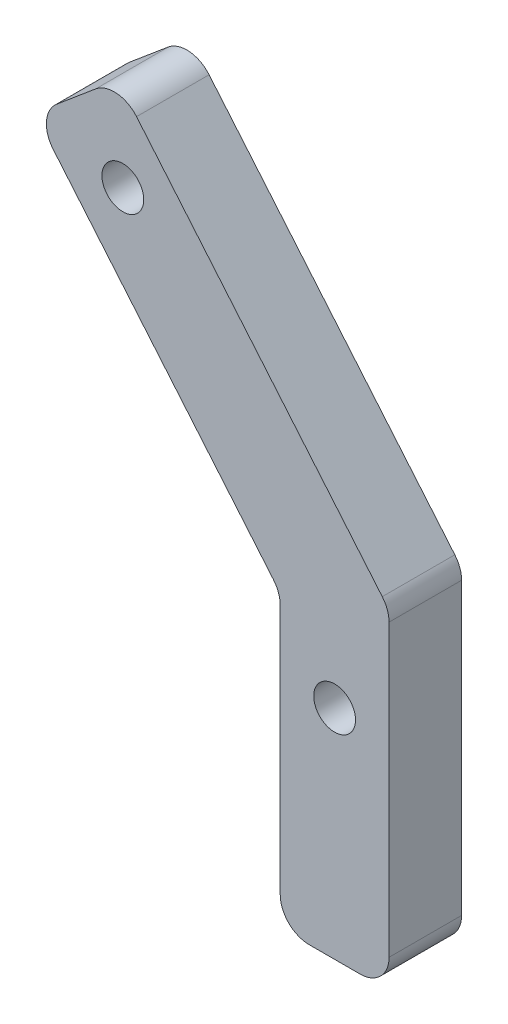
ISO-10303-21;
HEADER;
FILE_DESCRIPTION(('STEP AP214'),'2;1');
FILE_NAME('part.step','',(''),(''),'','','');
FILE_SCHEMA(('AUTOMOTIVE_DESIGN { 1 0 10303 214 1 1 1 1 }'));
ENDSEC;
DATA;
#1=APPLICATION_CONTEXT('core data for automotive mechanical design processes');
#2=APPLICATION_PROTOCOL_DEFINITION('international standard','automotive_design',2000,#1);
#3=PRODUCT_CONTEXT('',#1,'mechanical');
#4=PRODUCT('Part','Part','',(#3));
#5=PRODUCT_RELATED_PRODUCT_CATEGORY('part','',(#4));
#6=PRODUCT_DEFINITION_FORMATION('','',#4);
#7=PRODUCT_DEFINITION_CONTEXT('part definition',#1,'design');
#8=PRODUCT_DEFINITION('design','',#6,#7);
#9=PRODUCT_DEFINITION_SHAPE('','',#8);
#10=(LENGTH_UNIT() NAMED_UNIT(*) SI_UNIT(.MILLI.,.METRE.));
#11=(NAMED_UNIT(*) PLANE_ANGLE_UNIT() SI_UNIT($,.RADIAN.));
#12=(NAMED_UNIT(*) SI_UNIT($,.STERADIAN.) SOLID_ANGLE_UNIT());
#13=UNCERTAINTY_MEASURE_WITH_UNIT(LENGTH_MEASURE(1.E-05),#10,'distance_accuracy_value','');
#14=(GEOMETRIC_REPRESENTATION_CONTEXT(3) GLOBAL_UNCERTAINTY_ASSIGNED_CONTEXT((#13)) GLOBAL_UNIT_ASSIGNED_CONTEXT((#10,
#11,#12)) REPRESENTATION_CONTEXT('',''));
#15=CARTESIAN_POINT('',(0.,0.,0.));
#16=DIRECTION('',(0.,0.,1.));
#17=DIRECTION('',(1.,0.,0.));
#18=AXIS2_PLACEMENT_3D('',#15,#16,#17);
#19=CARTESIAN_POINT('',(0.,0.,6.35));
#20=DIRECTION('',(0.766044443118977,0.64278760968654,0.));
#21=DIRECTION('',(-0.64278760968654,0.766044443118977,0.));
#22=AXIS2_PLACEMENT_3D('',#19,#20,#21);
#23=PLANE('',#22);
#24=DIRECTION('',(0.64278760968654,-0.766044443118977,0.));
#25=VECTOR('',#24,1.);
#26=CARTESIAN_POINT('',(0.,0.,0.));
#27=LINE('',#26,#25);
#28=CARTESIAN_POINT('',(1.63268052860381,-1.9457528855222,0.));
#29=VERTEX_POINT('',#28);
#30=CARTESIAN_POINT('',(20.9097350652192,-24.919251884168,0.));
#31=VERTEX_POINT('',#30);
#32=EDGE_CURVE('E231',#29,#31,#27,.T.);
#33=ORIENTED_EDGE('',*,*,#32,.T.);
#34=DIRECTION('',(0.,0.,-1.));
#35=VECTOR('',#34,1.);
#36=CARTESIAN_POINT('',(20.9097350652192,-24.919251884168,6.35));
#37=LINE('',#36,#35);
#38=CARTESIAN_POINT('',(20.9097350652192,-24.919251884168,6.35));
#39=VERTEX_POINT('',#38);
#40=EDGE_CURVE('E212',#31,#39,#37,.F.);
#41=ORIENTED_EDGE('',*,*,#40,.T.);
#42=DIRECTION('',(0.64278760968654,-0.766044443118977,0.));
#43=VECTOR('',#42,1.);
#44=CARTESIAN_POINT('',(0.,0.,6.35));
#45=LINE('',#44,#43);
#46=CARTESIAN_POINT('',(1.63268052860381,-1.9457528855222,6.35));
#47=VERTEX_POINT('',#46);
#48=EDGE_CURVE('E164',#47,#39,#45,.T.);
#49=ORIENTED_EDGE('',*,*,#48,.F.);
#50=DIRECTION('',(0.,0.,-1.));
#51=VECTOR('',#50,1.);
#52=CARTESIAN_POINT('',(1.63268052860381,-1.9457528855222,6.35));
#53=LINE('',#52,#51);
#54=EDGE_CURVE('E208',#47,#29,#53,.T.);
#55=ORIENTED_EDGE('',*,*,#54,.T.);
#56=EDGE_LOOP('',(#33,#41,#49,#55));
#57=FACE_BOUND('',#56,.T.);
#58=ADVANCED_FACE('F39',(#57),#23,.F.);
#59=CARTESIAN_POINT('',(21.503982179697,-25.6274480177357,6.35));
#60=DIRECTION('',(1.,0.,0.));
#61=DIRECTION('',(0.,0.,-1.));
#62=AXIS2_PLACEMENT_3D('',#59,#60,#61);
#63=PLANE('',#62);
#64=DIRECTION('',(0.,-1.,0.));
#65=VECTOR('',#64,1.);
#66=CARTESIAN_POINT('',(21.503982179697,-25.6274480177357,6.35));
#67=LINE('',#66,#65);
#68=CARTESIAN_POINT('',(21.503982179697,-26.5519324127719,6.35));
#69=VERTEX_POINT('',#68);
#70=CARTESIAN_POINT('',(21.503982179697,-48.4874480177357,6.35));
#71=VERTEX_POINT('',#70);
#72=EDGE_CURVE('E250',#69,#71,#67,.T.);
#73=ORIENTED_EDGE('',*,*,#72,.F.);
#74=DIRECTION('',(0.,0.,-1.));
#75=VECTOR('',#74,1.);
#76=CARTESIAN_POINT('',(21.503982179697,-26.5519324127719,0.));
#77=LINE('',#76,#75);
#78=CARTESIAN_POINT('',(21.503982179697,-26.5519324127719,0.));
#79=VERTEX_POINT('',#78);
#80=EDGE_CURVE('E204',#69,#79,#77,.T.);
#81=ORIENTED_EDGE('',*,*,#80,.T.);
#82=DIRECTION('',(0.,-1.,0.));
#83=VECTOR('',#82,1.);
#84=CARTESIAN_POINT('',(21.503982179697,-25.6274480177357,0.));
#85=LINE('',#84,#83);
#86=CARTESIAN_POINT('',(21.503982179697,-48.4874480177357,0.));
#87=VERTEX_POINT('',#86);
#88=EDGE_CURVE('E233',#79,#87,#85,.T.);
#89=ORIENTED_EDGE('',*,*,#88,.T.);
#90=DIRECTION('',(0.,0.,-1.));
#91=VECTOR('',#90,1.);
#92=CARTESIAN_POINT('',(21.503982179697,-48.4874480177357,6.35));
#93=LINE('',#92,#91);
#94=EDGE_CURVE('E201',#87,#71,#93,.F.);
#95=ORIENTED_EDGE('',*,*,#94,.T.);
#96=EDGE_LOOP('',(#73,#81,#89,#95));
#97=FACE_BOUND('',#96,.T.);
#98=ADVANCED_FACE('F253',(#97),#63,.F.);
#99=CARTESIAN_POINT('',(21.503982179697,-51.0274480177357,6.35));
#100=DIRECTION('',(0.,1.,0.));
#101=DIRECTION('',(0.,0.,1.));
#102=AXIS2_PLACEMENT_3D('',#99,#100,#101);
#103=PLANE('',#102);
#104=DIRECTION('',(1.,0.,0.));
#105=VECTOR('',#104,1.);
#106=CARTESIAN_POINT('',(21.503982179697,-51.0274480177357,0.));
#107=LINE('',#106,#105);
#108=CARTESIAN_POINT('',(24.043982179697,-51.0274480177357,0.));
#109=VERTEX_POINT('',#108);
#110=CARTESIAN_POINT('',(28.488982179697,-51.0274480177357,0.));
#111=VERTEX_POINT('',#110);
#112=EDGE_CURVE('E166',#109,#111,#107,.T.);
#113=ORIENTED_EDGE('',*,*,#112,.T.);
#114=DIRECTION('',(0.,0.,-1.));
#115=VECTOR('',#114,1.);
#116=CARTESIAN_POINT('',(28.488982179697,-51.0274480177357,6.35));
#117=LINE('',#116,#115);
#118=CARTESIAN_POINT('',(28.488982179697,-51.0274480177357,6.35));
#119=VERTEX_POINT('',#118);
#120=EDGE_CURVE('E225',#111,#119,#117,.F.);
#121=ORIENTED_EDGE('',*,*,#120,.T.);
#122=DIRECTION('',(1.,0.,0.));
#123=VECTOR('',#122,1.);
#124=CARTESIAN_POINT('',(21.503982179697,-51.0274480177357,6.35));
#125=LINE('',#124,#123);
#126=CARTESIAN_POINT('',(24.043982179697,-51.0274480177357,6.35));
#127=VERTEX_POINT('',#126);
#128=EDGE_CURVE('E256',#127,#119,#125,.T.);
#129=ORIENTED_EDGE('',*,*,#128,.F.);
#130=DIRECTION('',(0.,0.,-1.));
#131=VECTOR('',#130,1.);
#132=CARTESIAN_POINT('',(24.043982179697,-51.0274480177357,6.35));
#133=LINE('',#132,#131);
#134=EDGE_CURVE('E221',#127,#109,#133,.T.);
#135=ORIENTED_EDGE('',*,*,#134,.T.);
#136=EDGE_LOOP('',(#113,#121,#129,#135));
#137=FACE_BOUND('',#136,.T.);
#138=ADVANCED_FACE('F278',(#137),#103,.F.);
#139=CARTESIAN_POINT('',(31.028982179697,-22.1606315363501,6.35));
#140=DIRECTION('',(-1.,0.,0.));
#141=DIRECTION('',(0.,-1.,0.));
#142=AXIS2_PLACEMENT_3D('',#139,#140,#141);
#143=PLANE('',#142);
#144=DIRECTION('',(0.,1.,0.));
#145=VECTOR('',#144,1.);
#146=CARTESIAN_POINT('',(31.028982179697,-22.1606315363501,0.));
#147=LINE('',#146,#145);
#148=CARTESIAN_POINT('',(31.028982179697,-48.4874480177357,0.));
#149=VERTEX_POINT('',#148);
#150=CARTESIAN_POINT('',(31.028982179697,-23.0851159313863,0.));
#151=VERTEX_POINT('',#150);
#152=EDGE_CURVE('E160',#149,#151,#147,.T.);
#153=ORIENTED_EDGE('',*,*,#152,.T.);
#154=DIRECTION('',(0.,0.,-1.));
#155=VECTOR('',#154,1.);
#156=CARTESIAN_POINT('',(31.028982179697,-23.0851159313863,6.35));
#157=LINE('',#156,#155);
#158=CARTESIAN_POINT('',(31.028982179697,-23.0851159313863,6.35));
#159=VERTEX_POINT('',#158);
#160=EDGE_CURVE('E135',#151,#159,#157,.F.);
#161=ORIENTED_EDGE('',*,*,#160,.T.);
#162=DIRECTION('',(0.,1.,0.));
#163=VECTOR('',#162,1.);
#164=CARTESIAN_POINT('',(31.028982179697,-22.1606315363501,6.35));
#165=LINE('',#164,#163);
#166=CARTESIAN_POINT('',(31.028982179697,-48.4874480177357,6.35));
#167=VERTEX_POINT('',#166);
#168=EDGE_CURVE('E261',#167,#159,#165,.T.);
#169=ORIENTED_EDGE('',*,*,#168,.F.);
#170=DIRECTION('',(0.,0.,-1.));
#171=VECTOR('',#170,1.);
#172=CARTESIAN_POINT('',(31.028982179697,-48.4874480177357,6.35));
#173=LINE('',#172,#171);
#174=EDGE_CURVE('E141',#167,#149,#173,.T.);
#175=ORIENTED_EDGE('',*,*,#174,.T.);
#176=EDGE_LOOP('',(#153,#161,#169,#175));
#177=FACE_BOUND('',#176,.T.);
#178=ADVANCED_FACE('F287',(#177),#143,.F.);
#179=CARTESIAN_POINT('',(7.29657332070826,6.1225519822643,6.35));
#180=DIRECTION('',(-0.766044443118977,-0.64278760968654,0.));
#181=DIRECTION('',(0.642787609686541,-0.766044443118977,0.));
#182=AXIS2_PLACEMENT_3D('',#179,#180,#181);
#183=PLANE('',#182);
#184=DIRECTION('',(-0.642787609686541,0.766044443118977,0.));
#185=VECTOR('',#184,1.);
#186=CARTESIAN_POINT('',(7.29657332070826,6.1225519822643,6.35));
#187=LINE('',#186,#185);
#188=CARTESIAN_POINT('',(30.4347350652192,-21.4524354027824,6.35));
#189=VERTEX_POINT('',#188);
#190=CARTESIAN_POINT('',(8.92925384931207,4.1767990967421,6.35));
#191=VERTEX_POINT('',#190);
#192=EDGE_CURVE('E150',#189,#191,#187,.T.);
#193=ORIENTED_EDGE('',*,*,#192,.F.);
#194=DIRECTION('',(0.,0.,-1.));
#195=VECTOR('',#194,1.);
#196=CARTESIAN_POINT('',(30.4347350652192,-21.4524354027824,6.35));
#197=LINE('',#196,#195);
#198=CARTESIAN_POINT('',(30.4347350652192,-21.4524354027824,0.));
#199=VERTEX_POINT('',#198);
#200=EDGE_CURVE('E134',#189,#199,#197,.T.);
#201=ORIENTED_EDGE('',*,*,#200,.T.);
#202=DIRECTION('',(-0.642787609686541,0.766044443118977,0.));
#203=VECTOR('',#202,1.);
#204=CARTESIAN_POINT('',(7.29657332070826,6.1225519822643,0.));
#205=LINE('',#204,#203);
#206=CARTESIAN_POINT('',(8.92925384931207,4.1767990967421,0.));
#207=VERTEX_POINT('',#206);
#208=EDGE_CURVE('E148',#199,#207,#205,.T.);
#209=ORIENTED_EDGE('',*,*,#208,.T.);
#210=DIRECTION('',(0.,0.,-1.));
#211=VECTOR('',#210,1.);
#212=CARTESIAN_POINT('',(8.92925384931207,4.1767990967421,6.35));
#213=LINE('',#212,#211);
#214=EDGE_CURVE('E153',#207,#191,#213,.F.);
#215=ORIENTED_EDGE('',*,*,#214,.T.);
#216=EDGE_LOOP('',(#193,#201,#209,#215));
#217=FACE_BOUND('',#216,.T.);
#218=ADVANCED_FACE('F147',(#217),#183,.F.);
#219=CARTESIAN_POINT('',(0.,0.,6.35));
#220=DIRECTION('',(0.642787609686541,-0.766044443118977,0.));
#221=DIRECTION('',(0.766044443118977,0.642787609686541,0.));
#222=AXIS2_PLACEMENT_3D('',#219,#220,#221);
#223=PLANE('',#222);
#224=DIRECTION('',(-0.766044443118977,-0.642787609686541,0.));
#225=VECTOR('',#224,1.);
#226=CARTESIAN_POINT('',(0.,0.,0.));
#227=LINE('',#226,#225);
#228=CARTESIAN_POINT('',(5.35082043518606,4.48987145366049,0.));
#229=VERTEX_POINT('',#228);
#230=CARTESIAN_POINT('',(1.9457528855222,1.63268052860381,0.));
#231=VERTEX_POINT('',#230);
#232=EDGE_CURVE('E159',#229,#231,#227,.T.);
#233=ORIENTED_EDGE('',*,*,#232,.T.);
#234=DIRECTION('',(0.,0.,-1.));
#235=VECTOR('',#234,1.);
#236=CARTESIAN_POINT('',(1.9457528855222,1.63268052860381,6.35));
#237=LINE('',#236,#235);
#238=CARTESIAN_POINT('',(1.9457528855222,1.63268052860381,6.35));
#239=VERTEX_POINT('',#238);
#240=EDGE_CURVE('E55',#231,#239,#237,.F.);
#241=ORIENTED_EDGE('',*,*,#240,.T.);
#242=DIRECTION('',(-0.766044443118977,-0.642787609686541,0.));
#243=VECTOR('',#242,1.);
#244=CARTESIAN_POINT('',(0.,0.,6.35));
#245=LINE('',#244,#243);
#246=CARTESIAN_POINT('',(5.35082043518606,4.48987145366049,6.35));
#247=VERTEX_POINT('',#246);
#248=EDGE_CURVE('E171',#247,#239,#245,.T.);
#249=ORIENTED_EDGE('',*,*,#248,.F.);
#250=DIRECTION('',(0.,0.,-1.));
#251=VECTOR('',#250,1.);
#252=CARTESIAN_POINT('',(5.35082043518606,4.48987145366049,6.35));
#253=LINE('',#252,#251);
#254=EDGE_CURVE('E215',#247,#229,#253,.T.);
#255=ORIENTED_EDGE('',*,*,#254,.T.);
#256=EDGE_LOOP('',(#233,#241,#249,#255));
#257=FACE_BOUND('',#256,.T.);
#258=ADVANCED_FACE('F294',(#257),#223,.F.);
#259=CARTESIAN_POINT('',(0.,0.,6.35));
#260=DIRECTION('',(0.,0.,1.));
#261=DIRECTION('',(1.,0.,0.));
#262=AXIS2_PLACEMENT_3D('',#259,#260,#261);
#263=PLANE('',#262);
#264=CARTESIAN_POINT('',(7.72998798186366,-1.80310622267335,6.35));
#265=DIRECTION('',(0.,0.,1.));
#266=DIRECTION('',(1.,0.,0.));
#267=AXIS2_PLACEMENT_3D('',#264,#265,#266);
#268=CIRCLE('',#267,1.8288);
#269=CARTESIAN_POINT('',(9.55878798186366,-1.80310622267335,6.35));
#270=VERTEX_POINT('',#269);
#271=EDGE_CURVE('E443',#270,#270,#268,.T.);
#272=ORIENTED_EDGE('',*,*,#271,.F.);
#273=EDGE_LOOP('',(#272));
#274=FACE_BOUND('',#273,.T.);
#275=CARTESIAN_POINT('',(26.266482179697,-31.9774480177357,6.35));
#276=DIRECTION('',(0.,0.,1.));
#277=DIRECTION('',(1.,0.,0.));
#278=AXIS2_PLACEMENT_3D('',#275,#276,#277);
#279=CIRCLE('',#278,1.8288);
#280=CARTESIAN_POINT('',(28.095282179697,-31.9774480177357,6.35));
#281=VERTEX_POINT('',#280);
#282=EDGE_CURVE('E437',#281,#281,#279,.T.);
#283=ORIENTED_EDGE('',*,*,#282,.F.);
#284=EDGE_LOOP('',(#283));
#285=FACE_BOUND('',#284,.T.);
#286=ORIENTED_EDGE('',*,*,#168,.T.);
#287=CARTESIAN_POINT('',(28.488982179697,-23.0851159313863,6.35));
#288=DIRECTION('',(0.,0.,1.));
#289=DIRECTION('',(1.,0.,0.));
#290=AXIS2_PLACEMENT_3D('',#287,#288,#289);
#291=CIRCLE('',#290,2.54);
#292=EDGE_CURVE('E198',#159,#189,#291,.T.);
#293=ORIENTED_EDGE('',*,*,#292,.T.);
#294=ORIENTED_EDGE('',*,*,#192,.T.);
#295=CARTESIAN_POINT('',(6.98350096378987,2.54411856813829,6.35));
#296=DIRECTION('',(0.,0.,1.));
#297=DIRECTION('',(1.,0.,0.));
#298=AXIS2_PLACEMENT_3D('',#295,#296,#297);
#299=CIRCLE('',#298,2.54);
#300=EDGE_CURVE('E62',#191,#247,#299,.T.);
#301=ORIENTED_EDGE('',*,*,#300,.T.);
#302=ORIENTED_EDGE('',*,*,#248,.T.);
#303=CARTESIAN_POINT('',(3.57843341412601,-0.313072356918388,6.35));
#304=DIRECTION('',(0.,0.,1.));
#305=DIRECTION('',(1.,0.,0.));
#306=AXIS2_PLACEMENT_3D('',#303,#304,#305);
#307=CIRCLE('',#306,2.54);
#308=EDGE_CURVE('E195',#239,#47,#307,.T.);
#309=ORIENTED_EDGE('',*,*,#308,.T.);
#310=ORIENTED_EDGE('',*,*,#48,.T.);
#311=CARTESIAN_POINT('',(18.963982179697,-26.5519324127719,6.35));
#312=DIRECTION('',(0.,0.,1.));
#313=DIRECTION('',(1.,0.,0.));
#314=AXIS2_PLACEMENT_3D('',#311,#312,#313);
#315=CIRCLE('',#314,2.54);
#316=EDGE_CURVE('E11',#39,#69,#315,.F.);
#317=ORIENTED_EDGE('',*,*,#316,.T.);
#318=ORIENTED_EDGE('',*,*,#72,.T.);
#319=CARTESIAN_POINT('',(24.043982179697,-48.4874480177357,6.35));
#320=DIRECTION('',(0.,0.,1.));
#321=DIRECTION('',(1.,0.,0.));
#322=AXIS2_PLACEMENT_3D('',#319,#320,#321);
#323=CIRCLE('',#322,2.54);
#324=EDGE_CURVE('E187',#71,#127,#323,.T.);
#325=ORIENTED_EDGE('',*,*,#324,.T.);
#326=ORIENTED_EDGE('',*,*,#128,.T.);
#327=CARTESIAN_POINT('',(28.488982179697,-48.4874480177357,6.35));
#328=DIRECTION('',(0.,0.,1.));
#329=DIRECTION('',(1.,0.,0.));
#330=AXIS2_PLACEMENT_3D('',#327,#328,#329);
#331=CIRCLE('',#330,2.54);
#332=EDGE_CURVE('E190',#119,#167,#331,.T.);
#333=ORIENTED_EDGE('',*,*,#332,.T.);
#334=EDGE_LOOP('',(#286,#293,#294,#301,#302,#309,#310,#317,#318,#325,#326,#333));
#335=FACE_BOUND('',#334,.T.);
#336=ADVANCED_FACE('F249',(#274,#285,#335),#263,.T.);
#337=CARTESIAN_POINT('',(0.,0.,0.));
#338=DIRECTION('',(0.,0.,1.));
#339=DIRECTION('',(1.,0.,0.));
#340=AXIS2_PLACEMENT_3D('',#337,#338,#339);
#341=PLANE('',#340);
#342=CARTESIAN_POINT('',(7.72998798186366,-1.80310622267335,0.));
#343=DIRECTION('',(0.,0.,1.));
#344=DIRECTION('',(1.,0.,0.));
#345=AXIS2_PLACEMENT_3D('',#342,#343,#344);
#346=CIRCLE('',#345,1.8288);
#347=CARTESIAN_POINT('',(9.55878798186366,-1.80310622267335,0.));
#348=VERTEX_POINT('',#347);
#349=EDGE_CURVE('E433',#348,#348,#346,.T.);
#350=ORIENTED_EDGE('',*,*,#349,.T.);
#351=EDGE_LOOP('',(#350));
#352=FACE_BOUND('',#351,.T.);
#353=CARTESIAN_POINT('',(26.266482179697,-31.9774480177357,0.));
#354=DIRECTION('',(0.,0.,1.));
#355=DIRECTION('',(1.,0.,0.));
#356=AXIS2_PLACEMENT_3D('',#353,#354,#355);
#357=CIRCLE('',#356,1.8288);
#358=CARTESIAN_POINT('',(28.095282179697,-31.9774480177357,0.));
#359=VERTEX_POINT('',#358);
#360=EDGE_CURVE('E242',#359,#359,#357,.T.);
#361=ORIENTED_EDGE('',*,*,#360,.T.);
#362=EDGE_LOOP('',(#361));
#363=FACE_BOUND('',#362,.T.);
#364=ORIENTED_EDGE('',*,*,#208,.F.);
#365=CARTESIAN_POINT('',(28.488982179697,-23.0851159313863,0.));
#366=DIRECTION('',(0.,0.,1.));
#367=DIRECTION('',(1.,0.,0.));
#368=AXIS2_PLACEMENT_3D('',#365,#366,#367);
#369=CIRCLE('',#368,2.54);
#370=EDGE_CURVE('E130',#199,#151,#369,.F.);
#371=ORIENTED_EDGE('',*,*,#370,.T.);
#372=ORIENTED_EDGE('',*,*,#152,.F.);
#373=CARTESIAN_POINT('',(28.488982179697,-48.4874480177357,0.));
#374=DIRECTION('',(0.,0.,1.));
#375=DIRECTION('',(1.,0.,0.));
#376=AXIS2_PLACEMENT_3D('',#373,#374,#375);
#377=CIRCLE('',#376,2.54);
#378=EDGE_CURVE('E175',#149,#111,#377,.F.);
#379=ORIENTED_EDGE('',*,*,#378,.T.);
#380=ORIENTED_EDGE('',*,*,#112,.F.);
#381=CARTESIAN_POINT('',(24.043982179697,-48.4874480177357,0.));
#382=DIRECTION('',(0.,0.,1.));
#383=DIRECTION('',(1.,0.,0.));
#384=AXIS2_PLACEMENT_3D('',#381,#382,#383);
#385=CIRCLE('',#384,2.54);
#386=EDGE_CURVE('E152',#109,#87,#385,.F.);
#387=ORIENTED_EDGE('',*,*,#386,.T.);
#388=ORIENTED_EDGE('',*,*,#88,.F.);
#389=CARTESIAN_POINT('',(18.963982179697,-26.5519324127719,0.));
#390=DIRECTION('',(0.,0.,1.));
#391=DIRECTION('',(1.,0.,0.));
#392=AXIS2_PLACEMENT_3D('',#389,#390,#391);
#393=CIRCLE('',#392,2.54);
#394=EDGE_CURVE('E48',#79,#31,#393,.T.);
#395=ORIENTED_EDGE('',*,*,#394,.T.);
#396=ORIENTED_EDGE('',*,*,#32,.F.);
#397=CARTESIAN_POINT('',(3.57843341412601,-0.313072356918388,0.));
#398=DIRECTION('',(0.,0.,1.));
#399=DIRECTION('',(1.,0.,0.));
#400=AXIS2_PLACEMENT_3D('',#397,#398,#399);
#401=CIRCLE('',#400,2.54);
#402=EDGE_CURVE('E142',#29,#231,#401,.F.);
#403=ORIENTED_EDGE('',*,*,#402,.T.);
#404=ORIENTED_EDGE('',*,*,#232,.F.);
#405=CARTESIAN_POINT('',(6.98350096378987,2.54411856813829,0.));
#406=DIRECTION('',(0.,0.,1.));
#407=DIRECTION('',(1.,0.,0.));
#408=AXIS2_PLACEMENT_3D('',#405,#406,#407);
#409=CIRCLE('',#408,2.54);
#410=EDGE_CURVE('E157',#229,#207,#409,.F.);
#411=ORIENTED_EDGE('',*,*,#410,.T.);
#412=EDGE_LOOP('',(#364,#371,#372,#379,#380,#387,#388,#395,#396,#403,#404,#411));
#413=FACE_BOUND('',#412,.T.);
#414=ADVANCED_FACE('F155',(#352,#363,#413),#341,.F.);
#415=CARTESIAN_POINT('',(28.488982179697,-23.0851159313863,6.35));
#416=DIRECTION('',(0.,0.,-1.));
#417=DIRECTION('',(-1.,0.,0.));
#418=AXIS2_PLACEMENT_3D('',#415,#416,#417);
#419=CYLINDRICAL_SURFACE('',#418,2.54);
#420=ORIENTED_EDGE('',*,*,#292,.F.);
#421=ORIENTED_EDGE('',*,*,#160,.F.);
#422=ORIENTED_EDGE('',*,*,#370,.F.);
#423=ORIENTED_EDGE('',*,*,#200,.F.);
#424=EDGE_LOOP('',(#420,#421,#422,#423));
#425=FACE_BOUND('',#424,.T.);
#426=ADVANCED_FACE('F133',(#425),#419,.T.);
#427=CARTESIAN_POINT('',(18.963982179697,-26.5519324127719,6.35));
#428=DIRECTION('',(0.,0.,1.));
#429=DIRECTION('',(1.,0.,0.));
#430=AXIS2_PLACEMENT_3D('',#427,#428,#429);
#431=CYLINDRICAL_SURFACE('',#430,2.54);
#432=ORIENTED_EDGE('',*,*,#316,.F.);
#433=ORIENTED_EDGE('',*,*,#40,.F.);
#434=ORIENTED_EDGE('',*,*,#394,.F.);
#435=ORIENTED_EDGE('',*,*,#80,.F.);
#436=EDGE_LOOP('',(#432,#433,#434,#435));
#437=FACE_BOUND('',#436,.T.);
#438=ADVANCED_FACE('F245',(#437),#431,.F.);
#439=CARTESIAN_POINT('',(3.57843341412601,-0.313072356918388,6.35));
#440=DIRECTION('',(0.,0.,-1.));
#441=DIRECTION('',(-1.,0.,0.));
#442=AXIS2_PLACEMENT_3D('',#439,#440,#441);
#443=CYLINDRICAL_SURFACE('',#442,2.54);
#444=ORIENTED_EDGE('',*,*,#308,.F.);
#445=ORIENTED_EDGE('',*,*,#240,.F.);
#446=ORIENTED_EDGE('',*,*,#402,.F.);
#447=ORIENTED_EDGE('',*,*,#54,.F.);
#448=EDGE_LOOP('',(#444,#445,#446,#447));
#449=FACE_BOUND('',#448,.T.);
#450=ADVANCED_FACE('F308',(#449),#443,.T.);
#451=CARTESIAN_POINT('',(6.98350096378987,2.54411856813829,6.35));
#452=DIRECTION('',(0.,0.,-1.));
#453=DIRECTION('',(-1.,0.,0.));
#454=AXIS2_PLACEMENT_3D('',#451,#452,#453);
#455=CYLINDRICAL_SURFACE('',#454,2.54);
#456=ORIENTED_EDGE('',*,*,#300,.F.);
#457=ORIENTED_EDGE('',*,*,#214,.F.);
#458=ORIENTED_EDGE('',*,*,#410,.F.);
#459=ORIENTED_EDGE('',*,*,#254,.F.);
#460=EDGE_LOOP('',(#456,#457,#458,#459));
#461=FACE_BOUND('',#460,.T.);
#462=ADVANCED_FACE('F311',(#461),#455,.T.);
#463=CARTESIAN_POINT('',(28.488982179697,-48.4874480177357,6.35));
#464=DIRECTION('',(0.,0.,-1.));
#465=DIRECTION('',(-1.,0.,0.));
#466=AXIS2_PLACEMENT_3D('',#463,#464,#465);
#467=CYLINDRICAL_SURFACE('',#466,2.54);
#468=ORIENTED_EDGE('',*,*,#332,.F.);
#469=ORIENTED_EDGE('',*,*,#120,.F.);
#470=ORIENTED_EDGE('',*,*,#378,.F.);
#471=ORIENTED_EDGE('',*,*,#174,.F.);
#472=EDGE_LOOP('',(#468,#469,#470,#471));
#473=FACE_BOUND('',#472,.T.);
#474=ADVANCED_FACE('F283',(#473),#467,.T.);
#475=CARTESIAN_POINT('',(24.043982179697,-48.4874480177357,6.35));
#476=DIRECTION('',(0.,0.,-1.));
#477=DIRECTION('',(-1.,0.,0.));
#478=AXIS2_PLACEMENT_3D('',#475,#476,#477);
#479=CYLINDRICAL_SURFACE('',#478,2.54);
#480=ORIENTED_EDGE('',*,*,#324,.F.);
#481=ORIENTED_EDGE('',*,*,#94,.F.);
#482=ORIENTED_EDGE('',*,*,#386,.F.);
#483=ORIENTED_EDGE('',*,*,#134,.F.);
#484=EDGE_LOOP('',(#480,#481,#482,#483));
#485=FACE_BOUND('',#484,.T.);
#486=ADVANCED_FACE('F41',(#485),#479,.T.);
#487=CARTESIAN_POINT('',(26.266482179697,-31.9774480177357,6.35));
#488=DIRECTION('',(0.,0.,1.));
#489=DIRECTION('',(1.,0.,0.));
#490=AXIS2_PLACEMENT_3D('',#487,#488,#489);
#491=CYLINDRICAL_SURFACE('',#490,1.8288);
#492=ORIENTED_EDGE('',*,*,#282,.T.);
#493=EDGE_LOOP('',(#492));
#494=FACE_BOUND('',#493,.T.);
#495=ORIENTED_EDGE('',*,*,#360,.F.);
#496=EDGE_LOOP('',(#495));
#497=FACE_BOUND('',#496,.T.);
#498=ADVANCED_FACE('F319',(#494,#497),#491,.F.);
#499=CARTESIAN_POINT('',(7.72998798186366,-1.80310622267335,6.35));
#500=DIRECTION('',(0.,0.,1.));
#501=DIRECTION('',(1.,0.,0.));
#502=AXIS2_PLACEMENT_3D('',#499,#500,#501);
#503=CYLINDRICAL_SURFACE('',#502,1.8288);
#504=ORIENTED_EDGE('',*,*,#271,.T.);
#505=EDGE_LOOP('',(#504));
#506=FACE_BOUND('',#505,.T.);
#507=ORIENTED_EDGE('',*,*,#349,.F.);
#508=EDGE_LOOP('',(#507));
#509=FACE_BOUND('',#508,.T.);
#510=ADVANCED_FACE('F324',(#506,#509),#503,.F.);
#511=CLOSED_SHELL('',(#58,#98,#138,#178,#218,#258,#336,#414,#426,#438,#450,#462,#474,#486,#498,#510));
#512=MANIFOLD_SOLID_BREP('B2',#511);
#513=ADVANCED_BREP_SHAPE_REPRESENTATION('',(#18,#512),#14);
#514=SHAPE_DEFINITION_REPRESENTATION(#9,#513);
ENDSEC;
END-ISO-10303-21;
